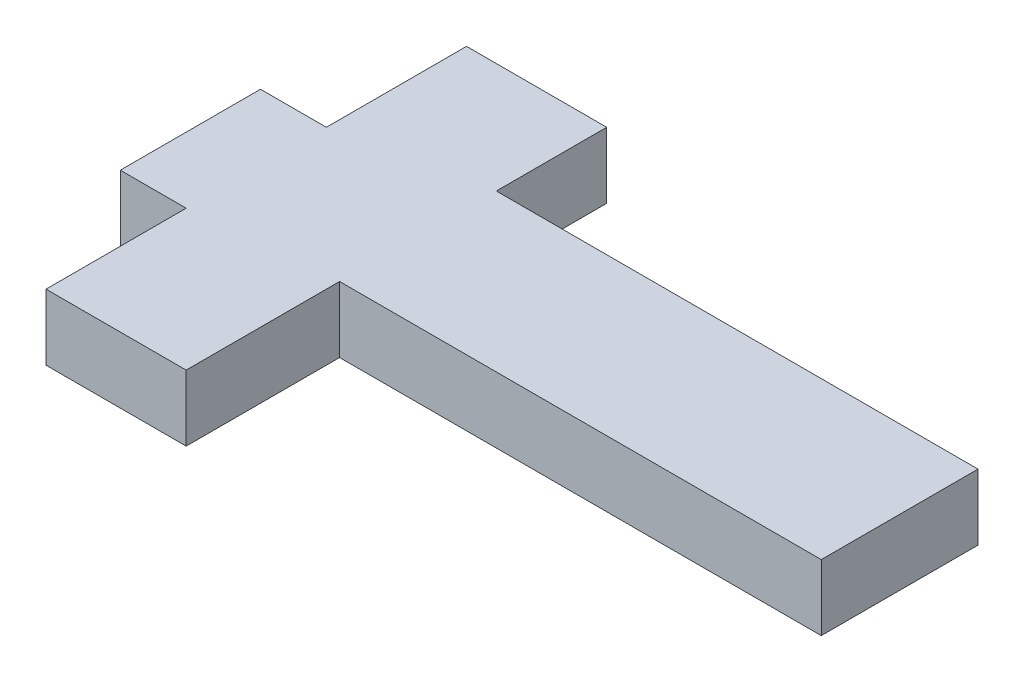
ISO-10303-21;
HEADER;
FILE_DESCRIPTION(('STEP AP214'),'2;1');
FILE_NAME('part.step','',(''),(''),'','','');
FILE_SCHEMA(('AUTOMOTIVE_DESIGN { 1 0 10303 214 1 1 1 1 }'));
ENDSEC;
DATA;
#1=APPLICATION_CONTEXT('core data for automotive mechanical design processes');
#2=APPLICATION_PROTOCOL_DEFINITION('international standard','automotive_design',2000,#1);
#3=PRODUCT_CONTEXT('',#1,'mechanical');
#4=PRODUCT('Part','Part','',(#3));
#5=PRODUCT_RELATED_PRODUCT_CATEGORY('part','',(#4));
#6=PRODUCT_DEFINITION_FORMATION('','',#4);
#7=PRODUCT_DEFINITION_CONTEXT('part definition',#1,'design');
#8=PRODUCT_DEFINITION('design','',#6,#7);
#9=PRODUCT_DEFINITION_SHAPE('','',#8);
#10=(LENGTH_UNIT() NAMED_UNIT(*) SI_UNIT(.MILLI.,.METRE.));
#11=(NAMED_UNIT(*) PLANE_ANGLE_UNIT() SI_UNIT($,.RADIAN.));
#12=(NAMED_UNIT(*) SI_UNIT($,.STERADIAN.) SOLID_ANGLE_UNIT());
#13=UNCERTAINTY_MEASURE_WITH_UNIT(LENGTH_MEASURE(1.E-05),#10,'distance_accuracy_value','');
#14=(GEOMETRIC_REPRESENTATION_CONTEXT(3) GLOBAL_UNCERTAINTY_ASSIGNED_CONTEXT((#13)) GLOBAL_UNIT_ASSIGNED_CONTEXT((#10,
#11,#12)) REPRESENTATION_CONTEXT('',''));
#15=CARTESIAN_POINT('',(0.,0.,0.));
#16=DIRECTION('',(0.,0.,1.));
#17=DIRECTION('',(1.,0.,0.));
#18=AXIS2_PLACEMENT_3D('',#15,#16,#17);
#19=CARTESIAN_POINT('',(0.,5.969,-12.7));
#20=DIRECTION('',(1.,0.,0.));
#21=DIRECTION('',(0.,0.,-1.));
#22=AXIS2_PLACEMENT_3D('',#19,#20,#21);
#23=PLANE('',#22);
#24=DIRECTION('',(0.,0.,1.));
#25=VECTOR('',#24,1.);
#26=CARTESIAN_POINT('',(0.,0.,-12.7));
#27=LINE('',#26,#25);
#28=CARTESIAN_POINT('',(0.,0.,-12.7));
#29=VERTEX_POINT('',#28);
#30=CARTESIAN_POINT('',(0.,0.,0.));
#31=VERTEX_POINT('',#30);
#32=EDGE_CURVE('E146',#29,#31,#27,.T.);
#33=ORIENTED_EDGE('',*,*,#32,.T.);
#34=DIRECTION('',(0.,-1.,0.));
#35=VECTOR('',#34,1.);
#36=CARTESIAN_POINT('',(0.,5.969,0.));
#37=LINE('',#36,#35);
#38=CARTESIAN_POINT('',(0.,5.969,0.));
#39=VERTEX_POINT('',#38);
#40=EDGE_CURVE('E11',#39,#31,#37,.T.);
#41=ORIENTED_EDGE('',*,*,#40,.F.);
#42=DIRECTION('',(0.,0.,1.));
#43=VECTOR('',#42,1.);
#44=CARTESIAN_POINT('',(0.,5.969,-12.7));
#45=LINE('',#44,#43);
#46=CARTESIAN_POINT('',(0.,5.969,-12.7));
#47=VERTEX_POINT('',#46);
#48=EDGE_CURVE('E168',#47,#39,#45,.T.);
#49=ORIENTED_EDGE('',*,*,#48,.F.);
#50=DIRECTION('',(0.,-1.,0.));
#51=VECTOR('',#50,1.);
#52=CARTESIAN_POINT('',(0.,5.969,-12.7));
#53=LINE('',#52,#51);
#54=EDGE_CURVE('E142',#47,#29,#53,.T.);
#55=ORIENTED_EDGE('',*,*,#54,.T.);
#56=EDGE_LOOP('',(#33,#41,#49,#55));
#57=FACE_BOUND('',#56,.T.);
#58=ADVANCED_FACE('F34',(#57),#23,.F.);
#59=CARTESIAN_POINT('',(0.,5.969,0.));
#60=DIRECTION('',(0.,0.,-1.));
#61=DIRECTION('',(-1.,0.,0.));
#62=AXIS2_PLACEMENT_3D('',#59,#60,#61);
#63=PLANE('',#62);
#64=DIRECTION('',(1.,0.,0.));
#65=VECTOR('',#64,1.);
#66=CARTESIAN_POINT('',(0.,0.,0.));
#67=LINE('',#66,#65);
#68=CARTESIAN_POINT('',(12.7,0.,0.));
#69=VERTEX_POINT('',#68);
#70=EDGE_CURVE('E149',#31,#69,#67,.T.);
#71=ORIENTED_EDGE('',*,*,#70,.T.);
#72=DIRECTION('',(0.,-1.,0.));
#73=VECTOR('',#72,1.);
#74=CARTESIAN_POINT('',(12.7,5.969,0.));
#75=LINE('',#74,#73);
#76=CARTESIAN_POINT('',(12.7,5.969,0.));
#77=VERTEX_POINT('',#76);
#78=EDGE_CURVE('E42',#77,#69,#75,.T.);
#79=ORIENTED_EDGE('',*,*,#78,.F.);
#80=DIRECTION('',(1.,0.,0.));
#81=VECTOR('',#80,1.);
#82=CARTESIAN_POINT('',(0.,5.969,0.));
#83=LINE('',#82,#81);
#84=EDGE_CURVE('E100',#39,#77,#83,.T.);
#85=ORIENTED_EDGE('',*,*,#84,.F.);
#86=ORIENTED_EDGE('',*,*,#40,.T.);
#87=EDGE_LOOP('',(#71,#79,#85,#86));
#88=FACE_BOUND('',#87,.T.);
#89=ADVANCED_FACE('F253',(#88),#63,.F.);
#90=CARTESIAN_POINT('',(12.7,5.969,0.));
#91=DIRECTION('',(-1.,0.,0.));
#92=DIRECTION('',(0.,0.,1.));
#93=AXIS2_PLACEMENT_3D('',#90,#91,#92);
#94=PLANE('',#93);
#95=DIRECTION('',(0.,0.,-1.));
#96=VECTOR('',#95,1.);
#97=CARTESIAN_POINT('',(12.7,0.,0.));
#98=LINE('',#97,#96);
#99=CARTESIAN_POINT('',(12.7,0.,-13.9));
#100=VERTEX_POINT('',#99);
#101=EDGE_CURVE('E152',#69,#100,#98,.T.);
#102=ORIENTED_EDGE('',*,*,#101,.T.);
#103=DIRECTION('',(0.,-1.,0.));
#104=VECTOR('',#103,1.);
#105=CARTESIAN_POINT('',(12.7,5.969,-13.9));
#106=LINE('',#105,#104);
#107=CARTESIAN_POINT('',(12.7,5.969,-13.9));
#108=VERTEX_POINT('',#107);
#109=EDGE_CURVE('E181',#108,#100,#106,.T.);
#110=ORIENTED_EDGE('',*,*,#109,.F.);
#111=DIRECTION('',(0.,0.,-1.));
#112=VECTOR('',#111,1.);
#113=CARTESIAN_POINT('',(12.7,5.969,0.));
#114=LINE('',#113,#112);
#115=EDGE_CURVE('E189',#77,#108,#114,.T.);
#116=ORIENTED_EDGE('',*,*,#115,.F.);
#117=ORIENTED_EDGE('',*,*,#78,.T.);
#118=EDGE_LOOP('',(#102,#110,#116,#117));
#119=FACE_BOUND('',#118,.T.);
#120=ADVANCED_FACE('F187',(#119),#94,.F.);
#121=CARTESIAN_POINT('',(12.7,5.969,-13.9));
#122=DIRECTION('',(0.,0.,-1.));
#123=DIRECTION('',(-1.,0.,0.));
#124=AXIS2_PLACEMENT_3D('',#121,#122,#123);
#125=PLANE('',#124);
#126=DIRECTION('',(1.,0.,0.));
#127=VECTOR('',#126,1.);
#128=CARTESIAN_POINT('',(12.7,0.,-13.9));
#129=LINE('',#128,#127);
#130=CARTESIAN_POINT('',(56.338,0.,-13.9));
#131=VERTEX_POINT('',#130);
#132=EDGE_CURVE('E154',#100,#131,#129,.T.);
#133=ORIENTED_EDGE('',*,*,#132,.T.);
#134=DIRECTION('',(0.,-1.,0.));
#135=VECTOR('',#134,1.);
#136=CARTESIAN_POINT('',(56.338,46.2255964905132,-13.9));
#137=LINE('',#136,#135);
#138=CARTESIAN_POINT('',(56.338,5.969,-13.9));
#139=VERTEX_POINT('',#138);
#140=EDGE_CURVE('E150',#139,#131,#137,.T.);
#141=ORIENTED_EDGE('',*,*,#140,.F.);
#142=DIRECTION('',(1.,0.,0.));
#143=VECTOR('',#142,1.);
#144=CARTESIAN_POINT('',(12.7,5.969,-13.9));
#145=LINE('',#144,#143);
#146=EDGE_CURVE('E221',#108,#139,#145,.T.);
#147=ORIENTED_EDGE('',*,*,#146,.F.);
#148=ORIENTED_EDGE('',*,*,#109,.T.);
#149=EDGE_LOOP('',(#133,#141,#147,#148));
#150=FACE_BOUND('',#149,.T.);
#151=ADVANCED_FACE('F201',(#150),#125,.F.);
#152=CARTESIAN_POINT('',(18.669,5.969,-28.1));
#153=DIRECTION('',(0.,0.,1.));
#154=DIRECTION('',(1.,0.,0.));
#155=AXIS2_PLACEMENT_3D('',#152,#153,#154);
#156=PLANE('',#155);
#157=DIRECTION('',(-1.,0.,0.));
#158=VECTOR('',#157,1.);
#159=CARTESIAN_POINT('',(18.669,0.,-28.1));
#160=LINE('',#159,#158);
#161=CARTESIAN_POINT('',(56.338,0.,-28.1));
#162=VERTEX_POINT('',#161);
#163=CARTESIAN_POINT('',(12.7,0.,-28.1));
#164=VERTEX_POINT('',#163);
#165=EDGE_CURVE('E157',#162,#164,#160,.T.);
#166=ORIENTED_EDGE('',*,*,#165,.T.);
#167=DIRECTION('',(0.,-1.,0.));
#168=VECTOR('',#167,1.);
#169=CARTESIAN_POINT('',(12.7,5.969,-28.1));
#170=LINE('',#169,#168);
#171=CARTESIAN_POINT('',(12.7,5.969,-28.1));
#172=VERTEX_POINT('',#171);
#173=EDGE_CURVE('E178',#172,#164,#170,.T.);
#174=ORIENTED_EDGE('',*,*,#173,.F.);
#175=DIRECTION('',(-1.,0.,0.));
#176=VECTOR('',#175,1.);
#177=CARTESIAN_POINT('',(18.669,5.969,-28.1));
#178=LINE('',#177,#176);
#179=CARTESIAN_POINT('',(56.338,5.969,-28.1));
#180=VERTEX_POINT('',#179);
#181=EDGE_CURVE('E224',#180,#172,#178,.T.);
#182=ORIENTED_EDGE('',*,*,#181,.F.);
#183=DIRECTION('',(0.,-1.,0.));
#184=VECTOR('',#183,1.);
#185=CARTESIAN_POINT('',(56.338,46.2255964905132,-28.1));
#186=LINE('',#185,#184);
#187=EDGE_CURVE('E212',#180,#162,#186,.T.);
#188=ORIENTED_EDGE('',*,*,#187,.T.);
#189=EDGE_LOOP('',(#166,#174,#182,#188));
#190=FACE_BOUND('',#189,.T.);
#191=ADVANCED_FACE('F264',(#190),#156,.F.);
#192=CARTESIAN_POINT('',(12.7,5.969,-28.1));
#193=DIRECTION('',(-1.,0.,0.));
#194=DIRECTION('',(0.,0.,1.));
#195=AXIS2_PLACEMENT_3D('',#192,#193,#194);
#196=PLANE('',#195);
#197=DIRECTION('',(0.,0.,-1.));
#198=VECTOR('',#197,1.);
#199=CARTESIAN_POINT('',(12.7,0.,-28.1));
#200=LINE('',#199,#198);
#201=CARTESIAN_POINT('',(12.7,0.,-38.1));
#202=VERTEX_POINT('',#201);
#203=EDGE_CURVE('E159',#164,#202,#200,.T.);
#204=ORIENTED_EDGE('',*,*,#203,.T.);
#205=DIRECTION('',(0.,-1.,0.));
#206=VECTOR('',#205,1.);
#207=CARTESIAN_POINT('',(12.7,5.969,-38.1));
#208=LINE('',#207,#206);
#209=CARTESIAN_POINT('',(12.7,5.969,-38.1));
#210=VERTEX_POINT('',#209);
#211=EDGE_CURVE('E175',#210,#202,#208,.T.);
#212=ORIENTED_EDGE('',*,*,#211,.F.);
#213=DIRECTION('',(0.,0.,-1.));
#214=VECTOR('',#213,1.);
#215=CARTESIAN_POINT('',(12.7,5.969,-28.1));
#216=LINE('',#215,#214);
#217=EDGE_CURVE('E226',#172,#210,#216,.T.);
#218=ORIENTED_EDGE('',*,*,#217,.F.);
#219=ORIENTED_EDGE('',*,*,#173,.T.);
#220=EDGE_LOOP('',(#204,#212,#218,#219));
#221=FACE_BOUND('',#220,.T.);
#222=ADVANCED_FACE('F267',(#221),#196,.F.);
#223=CARTESIAN_POINT('',(12.7,5.969,-38.1));
#224=DIRECTION('',(0.,0.,1.));
#225=DIRECTION('',(1.,0.,0.));
#226=AXIS2_PLACEMENT_3D('',#223,#224,#225);
#227=PLANE('',#226);
#228=DIRECTION('',(-1.,0.,0.));
#229=VECTOR('',#228,1.);
#230=CARTESIAN_POINT('',(12.7,0.,-38.1));
#231=LINE('',#230,#229);
#232=CARTESIAN_POINT('',(0.,0.,-38.1));
#233=VERTEX_POINT('',#232);
#234=EDGE_CURVE('E161',#202,#233,#231,.T.);
#235=ORIENTED_EDGE('',*,*,#234,.T.);
#236=DIRECTION('',(0.,-1.,0.));
#237=VECTOR('',#236,1.);
#238=CARTESIAN_POINT('',(0.,5.969,-38.1));
#239=LINE('',#238,#237);
#240=CARTESIAN_POINT('',(0.,5.969,-38.1));
#241=VERTEX_POINT('',#240);
#242=EDGE_CURVE('E172',#241,#233,#239,.T.);
#243=ORIENTED_EDGE('',*,*,#242,.F.);
#244=DIRECTION('',(-1.,0.,0.));
#245=VECTOR('',#244,1.);
#246=CARTESIAN_POINT('',(12.7,5.969,-38.1));
#247=LINE('',#246,#245);
#248=EDGE_CURVE('E228',#210,#241,#247,.T.);
#249=ORIENTED_EDGE('',*,*,#248,.F.);
#250=ORIENTED_EDGE('',*,*,#211,.T.);
#251=EDGE_LOOP('',(#235,#243,#249,#250));
#252=FACE_BOUND('',#251,.T.);
#253=ADVANCED_FACE('F234',(#252),#227,.F.);
#254=CARTESIAN_POINT('',(0.,5.969,-38.1));
#255=DIRECTION('',(1.,0.,0.));
#256=DIRECTION('',(0.,0.,-1.));
#257=AXIS2_PLACEMENT_3D('',#254,#255,#256);
#258=PLANE('',#257);
#259=DIRECTION('',(0.,0.,1.));
#260=VECTOR('',#259,1.);
#261=CARTESIAN_POINT('',(0.,0.,-38.1));
#262=LINE('',#261,#260);
#263=CARTESIAN_POINT('',(0.,0.,-25.4));
#264=VERTEX_POINT('',#263);
#265=EDGE_CURVE('E163',#233,#264,#262,.T.);
#266=ORIENTED_EDGE('',*,*,#265,.T.);
#267=DIRECTION('',(0.,-1.,0.));
#268=VECTOR('',#267,1.);
#269=CARTESIAN_POINT('',(0.,5.969,-25.4));
#270=LINE('',#269,#268);
#271=CARTESIAN_POINT('',(0.,5.969,-25.4));
#272=VERTEX_POINT('',#271);
#273=EDGE_CURVE('E137',#272,#264,#270,.T.);
#274=ORIENTED_EDGE('',*,*,#273,.F.);
#275=DIRECTION('',(0.,0.,1.));
#276=VECTOR('',#275,1.);
#277=CARTESIAN_POINT('',(0.,5.969,-38.1));
#278=LINE('',#277,#276);
#279=EDGE_CURVE('E128',#241,#272,#278,.T.);
#280=ORIENTED_EDGE('',*,*,#279,.F.);
#281=ORIENTED_EDGE('',*,*,#242,.T.);
#282=EDGE_LOOP('',(#266,#274,#280,#281));
#283=FACE_BOUND('',#282,.T.);
#284=ADVANCED_FACE('F238',(#283),#258,.F.);
#285=CARTESIAN_POINT('',(0.,5.969,-25.4));
#286=DIRECTION('',(0.,0.,1.));
#287=DIRECTION('',(1.,0.,0.));
#288=AXIS2_PLACEMENT_3D('',#285,#286,#287);
#289=PLANE('',#288);
#290=DIRECTION('',(-1.,0.,0.));
#291=VECTOR('',#290,1.);
#292=CARTESIAN_POINT('',(0.,0.,-25.4));
#293=LINE('',#292,#291);
#294=CARTESIAN_POINT('',(-5.969,0.,-25.4));
#295=VERTEX_POINT('',#294);
#296=EDGE_CURVE('E136',#264,#295,#293,.T.);
#297=ORIENTED_EDGE('',*,*,#296,.T.);
#298=DIRECTION('',(0.,-1.,0.));
#299=VECTOR('',#298,1.);
#300=CARTESIAN_POINT('',(-5.969,5.969,-25.4));
#301=LINE('',#300,#299);
#302=CARTESIAN_POINT('',(-5.969,5.969,-25.4));
#303=VERTEX_POINT('',#302);
#304=EDGE_CURVE('E133',#303,#295,#301,.T.);
#305=ORIENTED_EDGE('',*,*,#304,.F.);
#306=DIRECTION('',(-1.,0.,0.));
#307=VECTOR('',#306,1.);
#308=CARTESIAN_POINT('',(0.,5.969,-25.4));
#309=LINE('',#308,#307);
#310=EDGE_CURVE('E122',#272,#303,#309,.T.);
#311=ORIENTED_EDGE('',*,*,#310,.F.);
#312=ORIENTED_EDGE('',*,*,#273,.T.);
#313=EDGE_LOOP('',(#297,#305,#311,#312));
#314=FACE_BOUND('',#313,.T.);
#315=ADVANCED_FACE('F134',(#314),#289,.F.);
#316=CARTESIAN_POINT('',(-5.969,5.969,-25.4));
#317=DIRECTION('',(1.,0.,0.));
#318=DIRECTION('',(0.,0.,-1.));
#319=AXIS2_PLACEMENT_3D('',#316,#317,#318);
#320=PLANE('',#319);
#321=DIRECTION('',(0.,0.,1.));
#322=VECTOR('',#321,1.);
#323=CARTESIAN_POINT('',(-5.969,0.,-25.4));
#324=LINE('',#323,#322);
#325=CARTESIAN_POINT('',(-5.969,0.,-12.7));
#326=VERTEX_POINT('',#325);
#327=EDGE_CURVE('E86',#295,#326,#324,.T.);
#328=ORIENTED_EDGE('',*,*,#327,.T.);
#329=DIRECTION('',(0.,-1.,0.));
#330=VECTOR('',#329,1.);
#331=CARTESIAN_POINT('',(-5.969,5.969,-12.7));
#332=LINE('',#331,#330);
#333=CARTESIAN_POINT('',(-5.969,5.969,-12.7));
#334=VERTEX_POINT('',#333);
#335=EDGE_CURVE('E138',#334,#326,#332,.T.);
#336=ORIENTED_EDGE('',*,*,#335,.F.);
#337=DIRECTION('',(0.,0.,1.));
#338=VECTOR('',#337,1.);
#339=CARTESIAN_POINT('',(-5.969,5.969,-25.4));
#340=LINE('',#339,#338);
#341=EDGE_CURVE('E126',#303,#334,#340,.T.);
#342=ORIENTED_EDGE('',*,*,#341,.F.);
#343=ORIENTED_EDGE('',*,*,#304,.T.);
#344=EDGE_LOOP('',(#328,#336,#342,#343));
#345=FACE_BOUND('',#344,.T.);
#346=ADVANCED_FACE('F140',(#345),#320,.F.);
#347=CARTESIAN_POINT('',(-5.969,5.969,-12.7));
#348=DIRECTION('',(0.,0.,-1.));
#349=DIRECTION('',(-1.,0.,0.));
#350=AXIS2_PLACEMENT_3D('',#347,#348,#349);
#351=PLANE('',#350);
#352=DIRECTION('',(1.,0.,0.));
#353=VECTOR('',#352,1.);
#354=CARTESIAN_POINT('',(-5.969,0.,-12.7));
#355=LINE('',#354,#353);
#356=EDGE_CURVE('E92',#326,#29,#355,.T.);
#357=ORIENTED_EDGE('',*,*,#356,.T.);
#358=ORIENTED_EDGE('',*,*,#54,.F.);
#359=DIRECTION('',(1.,0.,0.));
#360=VECTOR('',#359,1.);
#361=CARTESIAN_POINT('',(-5.969,5.969,-12.7));
#362=LINE('',#361,#360);
#363=EDGE_CURVE('E50',#334,#47,#362,.T.);
#364=ORIENTED_EDGE('',*,*,#363,.F.);
#365=ORIENTED_EDGE('',*,*,#335,.T.);
#366=EDGE_LOOP('',(#357,#358,#364,#365));
#367=FACE_BOUND('',#366,.T.);
#368=ADVANCED_FACE('F242',(#367),#351,.F.);
#369=CARTESIAN_POINT('',(0.,5.969,0.));
#370=DIRECTION('',(0.,1.,0.));
#371=DIRECTION('',(0.,0.,1.));
#372=AXIS2_PLACEMENT_3D('',#369,#370,#371);
#373=PLANE('',#372);
#374=ORIENTED_EDGE('',*,*,#48,.T.);
#375=ORIENTED_EDGE('',*,*,#84,.T.);
#376=ORIENTED_EDGE('',*,*,#115,.T.);
#377=ORIENTED_EDGE('',*,*,#146,.T.);
#378=DIRECTION('',(0.,0.,1.));
#379=VECTOR('',#378,1.);
#380=CARTESIAN_POINT('',(56.338,5.969,-28.1));
#381=LINE('',#380,#379);
#382=EDGE_CURVE('E210',#180,#139,#381,.T.);
#383=ORIENTED_EDGE('',*,*,#382,.F.);
#384=ORIENTED_EDGE('',*,*,#181,.T.);
#385=ORIENTED_EDGE('',*,*,#217,.T.);
#386=ORIENTED_EDGE('',*,*,#248,.T.);
#387=ORIENTED_EDGE('',*,*,#279,.T.);
#388=ORIENTED_EDGE('',*,*,#310,.T.);
#389=ORIENTED_EDGE('',*,*,#341,.T.);
#390=ORIENTED_EDGE('',*,*,#363,.T.);
#391=EDGE_LOOP('',(#374,#375,#376,#377,#383,#384,#385,#386,#387,#388,#389,#390));
#392=FACE_BOUND('',#391,.T.);
#393=ADVANCED_FACE('F124',(#392),#373,.T.);
#394=CARTESIAN_POINT('',(0.,0.,0.));
#395=DIRECTION('',(0.,1.,0.));
#396=DIRECTION('',(0.,0.,1.));
#397=AXIS2_PLACEMENT_3D('',#394,#395,#396);
#398=PLANE('',#397);
#399=ORIENTED_EDGE('',*,*,#32,.F.);
#400=ORIENTED_EDGE('',*,*,#356,.F.);
#401=ORIENTED_EDGE('',*,*,#327,.F.);
#402=ORIENTED_EDGE('',*,*,#296,.F.);
#403=ORIENTED_EDGE('',*,*,#265,.F.);
#404=ORIENTED_EDGE('',*,*,#234,.F.);
#405=ORIENTED_EDGE('',*,*,#203,.F.);
#406=ORIENTED_EDGE('',*,*,#165,.F.);
#407=DIRECTION('',(0.,0.,1.));
#408=VECTOR('',#407,1.);
#409=CARTESIAN_POINT('',(56.338,0.,-28.1));
#410=LINE('',#409,#408);
#411=EDGE_CURVE('E197',#162,#131,#410,.T.);
#412=ORIENTED_EDGE('',*,*,#411,.T.);
#413=ORIENTED_EDGE('',*,*,#132,.F.);
#414=ORIENTED_EDGE('',*,*,#101,.F.);
#415=ORIENTED_EDGE('',*,*,#70,.F.);
#416=EDGE_LOOP('',(#399,#400,#401,#402,#403,#404,#405,#406,#412,#413,#414,#415));
#417=FACE_BOUND('',#416,.T.);
#418=ADVANCED_FACE('F193',(#417),#398,.F.);
#419=CARTESIAN_POINT('',(56.338,46.2255964905132,-28.1));
#420=DIRECTION('',(1.,0.,0.));
#421=DIRECTION('',(0.,0.,-1.));
#422=AXIS2_PLACEMENT_3D('',#419,#420,#421);
#423=PLANE('',#422);
#424=ORIENTED_EDGE('',*,*,#187,.F.);
#425=ORIENTED_EDGE('',*,*,#382,.T.);
#426=ORIENTED_EDGE('',*,*,#140,.T.);
#427=ORIENTED_EDGE('',*,*,#411,.F.);
#428=EDGE_LOOP('',(#424,#425,#426,#427));
#429=FACE_BOUND('',#428,.T.);
#430=ADVANCED_FACE('F208',(#429),#423,.T.);
#431=CLOSED_SHELL('',(#58,#89,#120,#151,#191,#222,#253,#284,#315,#346,#368,#393,#418,#430));
#432=MANIFOLD_SOLID_BREP('B2',#431);
#433=ADVANCED_BREP_SHAPE_REPRESENTATION('',(#18,#432),#14);
#434=SHAPE_DEFINITION_REPRESENTATION(#9,#433);
ENDSEC;
END-ISO-10303-21;
